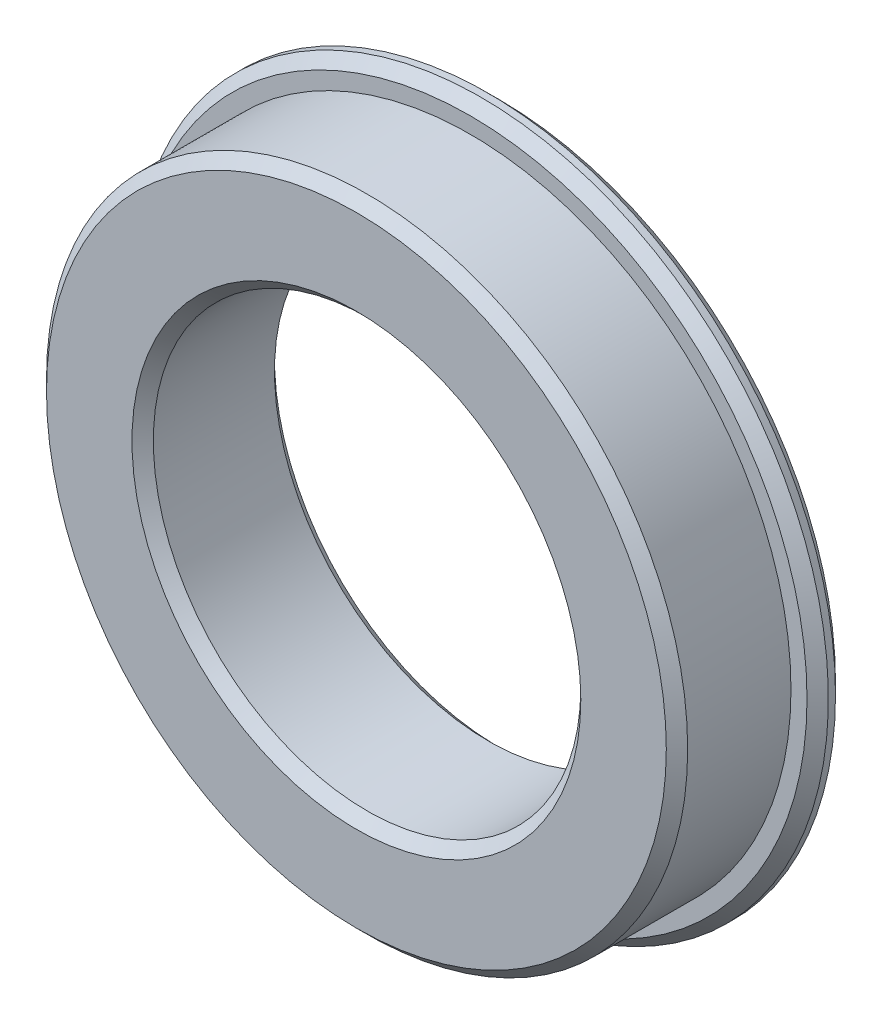
ISO-10303-21;
HEADER;
FILE_DESCRIPTION(('STEP AP214'),'2;1');
FILE_NAME('part.step','',(''),(''),'','','');
FILE_SCHEMA(('AUTOMOTIVE_DESIGN { 1 0 10303 214 1 1 1 1 }'));
ENDSEC;
DATA;
#1=APPLICATION_CONTEXT('core data for automotive mechanical design processes');
#2=APPLICATION_PROTOCOL_DEFINITION('international standard','automotive_design',2000,#1);
#3=PRODUCT_CONTEXT('',#1,'mechanical');
#4=PRODUCT('Part','Part','',(#3));
#5=PRODUCT_RELATED_PRODUCT_CATEGORY('part','',(#4));
#6=PRODUCT_DEFINITION_FORMATION('','',#4);
#7=PRODUCT_DEFINITION_CONTEXT('part definition',#1,'design');
#8=PRODUCT_DEFINITION('design','',#6,#7);
#9=PRODUCT_DEFINITION_SHAPE('','',#8);
#10=(LENGTH_UNIT() NAMED_UNIT(*) SI_UNIT(.MILLI.,.METRE.));
#11=(NAMED_UNIT(*) PLANE_ANGLE_UNIT() SI_UNIT($,.RADIAN.));
#12=(NAMED_UNIT(*) SI_UNIT($,.STERADIAN.) SOLID_ANGLE_UNIT());
#13=UNCERTAINTY_MEASURE_WITH_UNIT(LENGTH_MEASURE(1.E-05),#10,'distance_accuracy_value','');
#14=(GEOMETRIC_REPRESENTATION_CONTEXT(3) GLOBAL_UNCERTAINTY_ASSIGNED_CONTEXT((#13)) GLOBAL_UNIT_ASSIGNED_CONTEXT((#10,
#11,#12)) REPRESENTATION_CONTEXT('',''));
#15=CARTESIAN_POINT('',(0.,0.,0.));
#16=DIRECTION('',(0.,0.,1.));
#17=DIRECTION('',(1.,0.,0.));
#18=AXIS2_PLACEMENT_3D('',#15,#16,#17);
#19=CARTESIAN_POINT('',(0.,0.,4.));
#20=DIRECTION('',(0.,0.,-1.));
#21=DIRECTION('',(-1.,0.,0.));
#22=AXIS2_PLACEMENT_3D('',#19,#20,#21);
#23=CYLINDRICAL_SURFACE('',#22,9.);
#24=CARTESIAN_POINT('',(0.,0.,3.7));
#25=DIRECTION('',(0.,0.,1.));
#26=DIRECTION('',(1.,0.,0.));
#27=AXIS2_PLACEMENT_3D('',#24,#25,#26);
#28=CIRCLE('',#27,9.);
#29=CARTESIAN_POINT('',(9.,0.,3.7));
#30=VERTEX_POINT('',#29);
#31=EDGE_CURVE('E41',#30,#30,#28,.F.);
#32=ORIENTED_EDGE('',*,*,#31,.T.);
#33=EDGE_LOOP('',(#32));
#34=FACE_BOUND('',#33,.T.);
#35=CARTESIAN_POINT('',(0.,0.,0.8));
#36=DIRECTION('',(0.,0.,-1.));
#37=DIRECTION('',(-1.,0.,0.));
#38=AXIS2_PLACEMENT_3D('',#35,#36,#37);
#39=CIRCLE('',#38,9.);
#40=CARTESIAN_POINT('',(-9.,0.,0.8));
#41=VERTEX_POINT('',#40);
#42=EDGE_CURVE('E72',#41,#41,#39,.T.);
#43=ORIENTED_EDGE('',*,*,#42,.F.);
#44=EDGE_LOOP('',(#43));
#45=FACE_BOUND('',#44,.T.);
#46=ADVANCED_FACE('F33',(#34,#45),#23,.T.);
#47=CARTESIAN_POINT('',(0.,0.,4.));
#48=DIRECTION('',(0.,0.,1.));
#49=DIRECTION('',(1.,0.,0.));
#50=AXIS2_PLACEMENT_3D('',#47,#48,#49);
#51=PLANE('',#50);
#52=CARTESIAN_POINT('',(0.,0.,4.));
#53=DIRECTION('',(0.,0.,1.));
#54=DIRECTION('',(1.,0.,0.));
#55=AXIS2_PLACEMENT_3D('',#52,#53,#54);
#56=CIRCLE('',#55,6.30000000000001);
#57=CARTESIAN_POINT('',(6.30000000000001,0.,4.));
#58=VERTEX_POINT('',#57);
#59=EDGE_CURVE('E60',#58,#58,#56,.F.);
#60=ORIENTED_EDGE('',*,*,#59,.T.);
#61=EDGE_LOOP('',(#60));
#62=FACE_BOUND('',#61,.T.);
#63=CARTESIAN_POINT('',(0.,0.,4.));
#64=DIRECTION('',(0.,0.,1.));
#65=DIRECTION('',(1.,0.,0.));
#66=AXIS2_PLACEMENT_3D('',#63,#64,#65);
#67=CIRCLE('',#66,8.7);
#68=CARTESIAN_POINT('',(8.7,0.,4.));
#69=VERTEX_POINT('',#68);
#70=EDGE_CURVE('E63',#69,#69,#67,.T.);
#71=ORIENTED_EDGE('',*,*,#70,.T.);
#72=EDGE_LOOP('',(#71));
#73=FACE_BOUND('',#72,.T.);
#74=ADVANCED_FACE('F79',(#62,#73),#51,.T.);
#75=CARTESIAN_POINT('',(0.,0.,0.));
#76=DIRECTION('',(0.,0.,1.));
#77=DIRECTION('',(1.,0.,0.));
#78=AXIS2_PLACEMENT_3D('',#75,#76,#77);
#79=PLANE('',#78);
#80=CARTESIAN_POINT('',(0.,0.,0.));
#81=DIRECTION('',(0.,0.,1.));
#82=DIRECTION('',(1.,0.,0.));
#83=AXIS2_PLACEMENT_3D('',#80,#81,#82);
#84=CIRCLE('',#83,6.30000000000001);
#85=CARTESIAN_POINT('',(6.30000000000001,0.,0.));
#86=VERTEX_POINT('',#85);
#87=EDGE_CURVE('E54',#86,#86,#84,.T.);
#88=ORIENTED_EDGE('',*,*,#87,.T.);
#89=EDGE_LOOP('',(#88));
#90=FACE_BOUND('',#89,.T.);
#91=CARTESIAN_POINT('',(0.,0.,0.));
#92=DIRECTION('',(0.,0.,1.));
#93=DIRECTION('',(1.,0.,0.));
#94=AXIS2_PLACEMENT_3D('',#91,#92,#93);
#95=CIRCLE('',#94,9.45);
#96=CARTESIAN_POINT('',(9.45,0.,0.));
#97=VERTEX_POINT('',#96);
#98=EDGE_CURVE('E57',#97,#97,#95,.F.);
#99=ORIENTED_EDGE('',*,*,#98,.T.);
#100=EDGE_LOOP('',(#99));
#101=FACE_BOUND('',#100,.T.);
#102=ADVANCED_FACE('F84',(#90,#101),#79,.F.);
#103=CARTESIAN_POINT('',(0.,0.,4.));
#104=DIRECTION('',(0.,0.,-1.));
#105=DIRECTION('',(-1.,0.,0.));
#106=AXIS2_PLACEMENT_3D('',#103,#104,#105);
#107=CYLINDRICAL_SURFACE('',#106,6.);
#108=CARTESIAN_POINT('',(0.,0.,3.7));
#109=DIRECTION('',(0.,0.,1.));
#110=DIRECTION('',(1.,0.,0.));
#111=AXIS2_PLACEMENT_3D('',#108,#109,#110);
#112=CIRCLE('',#111,6.);
#113=CARTESIAN_POINT('',(6.,0.,3.7));
#114=VERTEX_POINT('',#113);
#115=EDGE_CURVE('E66',#114,#114,#112,.T.);
#116=ORIENTED_EDGE('',*,*,#115,.T.);
#117=EDGE_LOOP('',(#116));
#118=FACE_BOUND('',#117,.T.);
#119=CARTESIAN_POINT('',(0.,0.,0.300000000000008));
#120=DIRECTION('',(0.,0.,1.));
#121=DIRECTION('',(1.,0.,0.));
#122=AXIS2_PLACEMENT_3D('',#119,#120,#121);
#123=CIRCLE('',#122,6.);
#124=CARTESIAN_POINT('',(6.,0.,0.300000000000008));
#125=VERTEX_POINT('',#124);
#126=EDGE_CURVE('E69',#125,#125,#123,.F.);
#127=ORIENTED_EDGE('',*,*,#126,.T.);
#128=EDGE_LOOP('',(#127));
#129=FACE_BOUND('',#128,.T.);
#130=ADVANCED_FACE('F129',(#118,#129),#107,.F.);
#131=CARTESIAN_POINT('',(0.,0.,0.8));
#132=DIRECTION('',(0.,0.,-1.));
#133=DIRECTION('',(-1.,0.,0.));
#134=AXIS2_PLACEMENT_3D('',#131,#132,#133);
#135=CYLINDRICAL_SURFACE('',#134,9.75);
#136=CARTESIAN_POINT('',(0.,0.,0.300000000000003));
#137=DIRECTION('',(0.,0.,1.));
#138=DIRECTION('',(1.,0.,0.));
#139=AXIS2_PLACEMENT_3D('',#136,#137,#138);
#140=CIRCLE('',#139,9.75);
#141=CARTESIAN_POINT('',(9.75,0.,0.300000000000003));
#142=VERTEX_POINT('',#141);
#143=EDGE_CURVE('E45',#142,#142,#140,.T.);
#144=ORIENTED_EDGE('',*,*,#143,.T.);
#145=EDGE_LOOP('',(#144));
#146=FACE_BOUND('',#145,.T.);
#147=CARTESIAN_POINT('',(0.,0.,0.5));
#148=DIRECTION('',(0.,0.,-1.));
#149=DIRECTION('',(-1.,0.,0.));
#150=AXIS2_PLACEMENT_3D('',#147,#148,#149);
#151=CIRCLE('',#150,9.75);
#152=CARTESIAN_POINT('',(-9.75,0.,0.5));
#153=VERTEX_POINT('',#152);
#154=EDGE_CURVE('E49',#153,#153,#151,.T.);
#155=ORIENTED_EDGE('',*,*,#154,.T.);
#156=EDGE_LOOP('',(#155));
#157=FACE_BOUND('',#156,.T.);
#158=ADVANCED_FACE('F127',(#146,#157),#135,.T.);
#159=CARTESIAN_POINT('',(0.,0.,0.8));
#160=DIRECTION('',(0.,0.,-1.));
#161=DIRECTION('',(-1.,0.,0.));
#162=AXIS2_PLACEMENT_3D('',#159,#160,#161);
#163=PLANE('',#162);
#164=CARTESIAN_POINT('',(0.,0.,0.8));
#165=DIRECTION('',(0.,0.,-1.));
#166=DIRECTION('',(-1.,0.,0.));
#167=AXIS2_PLACEMENT_3D('',#164,#165,#166);
#168=CIRCLE('',#167,9.45);
#169=CARTESIAN_POINT('',(-9.45,0.,0.8));
#170=VERTEX_POINT('',#169);
#171=EDGE_CURVE('E10',#170,#170,#168,.F.);
#172=ORIENTED_EDGE('',*,*,#171,.T.);
#173=EDGE_LOOP('',(#172));
#174=FACE_BOUND('',#173,.T.);
#175=ORIENTED_EDGE('',*,*,#42,.T.);
#176=EDGE_LOOP('',(#175));
#177=FACE_BOUND('',#176,.T.);
#178=ADVANCED_FACE('F76',(#174,#177),#163,.F.);
#179=CARTESIAN_POINT('',(0.,0.,3.7));
#180=DIRECTION('',(0.,0.,1.));
#181=DIRECTION('',(1.,0.,0.));
#182=AXIS2_PLACEMENT_3D('',#179,#180,#181);
#183=CONICAL_SURFACE('',#182,6.,0.785398163397454);
#184=ORIENTED_EDGE('',*,*,#59,.F.);
#185=EDGE_LOOP('',(#184));
#186=FACE_BOUND('',#185,.T.);
#187=ORIENTED_EDGE('',*,*,#115,.F.);
#188=EDGE_LOOP('',(#187));
#189=FACE_BOUND('',#188,.T.);
#190=ADVANCED_FACE('F90',(#186,#189),#183,.F.);
#191=CARTESIAN_POINT('',(0.,0.,0.));
#192=DIRECTION('',(0.,0.,-1.));
#193=DIRECTION('',(-1.,0.,0.));
#194=AXIS2_PLACEMENT_3D('',#191,#192,#193);
#195=CONICAL_SURFACE('',#194,6.30000000000001,0.785398163397451);
#196=ORIENTED_EDGE('',*,*,#126,.F.);
#197=EDGE_LOOP('',(#196));
#198=FACE_BOUND('',#197,.T.);
#199=ORIENTED_EDGE('',*,*,#87,.F.);
#200=EDGE_LOOP('',(#199));
#201=FACE_BOUND('',#200,.T.);
#202=ADVANCED_FACE('F96',(#198,#201),#195,.F.);
#203=CARTESIAN_POINT('',(0.,0.,0.));
#204=DIRECTION('',(0.,0.,1.));
#205=DIRECTION('',(1.,0.,0.));
#206=AXIS2_PLACEMENT_3D('',#203,#204,#205);
#207=CONICAL_SURFACE('',#206,9.45,0.785398163397443);
#208=ORIENTED_EDGE('',*,*,#143,.F.);
#209=EDGE_LOOP('',(#208));
#210=FACE_BOUND('',#209,.T.);
#211=ORIENTED_EDGE('',*,*,#98,.F.);
#212=EDGE_LOOP('',(#211));
#213=FACE_BOUND('',#212,.T.);
#214=ADVANCED_FACE('F103',(#210,#213),#207,.T.);
#215=CARTESIAN_POINT('',(0.,0.,4.));
#216=DIRECTION('',(0.,0.,-1.));
#217=DIRECTION('',(-1.,0.,0.));
#218=AXIS2_PLACEMENT_3D('',#215,#216,#217);
#219=CONICAL_SURFACE('',#218,8.7,0.785398163397448);
#220=ORIENTED_EDGE('',*,*,#31,.F.);
#221=EDGE_LOOP('',(#220));
#222=FACE_BOUND('',#221,.T.);
#223=ORIENTED_EDGE('',*,*,#70,.F.);
#224=EDGE_LOOP('',(#223));
#225=FACE_BOUND('',#224,.T.);
#226=ADVANCED_FACE('F109',(#222,#225),#219,.T.);
#227=CARTESIAN_POINT('',(0.,0.,0.5));
#228=DIRECTION('',(0.,0.,-1.));
#229=DIRECTION('',(-1.,0.,0.));
#230=AXIS2_PLACEMENT_3D('',#227,#228,#229);
#231=CONICAL_SURFACE('',#230,9.75,0.785398163397451);
#232=ORIENTED_EDGE('',*,*,#171,.F.);
#233=EDGE_LOOP('',(#232));
#234=FACE_BOUND('',#233,.T.);
#235=ORIENTED_EDGE('',*,*,#154,.F.);
#236=EDGE_LOOP('',(#235));
#237=FACE_BOUND('',#236,.T.);
#238=ADVANCED_FACE('F36',(#234,#237),#231,.T.);
#239=CLOSED_SHELL('',(#46,#74,#102,#130,#158,#178,#190,#202,#214,#226,#238));
#240=MANIFOLD_SOLID_BREP('B2',#239);
#241=ADVANCED_BREP_SHAPE_REPRESENTATION('',(#18,#240),#14);
#242=SHAPE_DEFINITION_REPRESENTATION(#9,#241);
ENDSEC;
END-ISO-10303-21;
